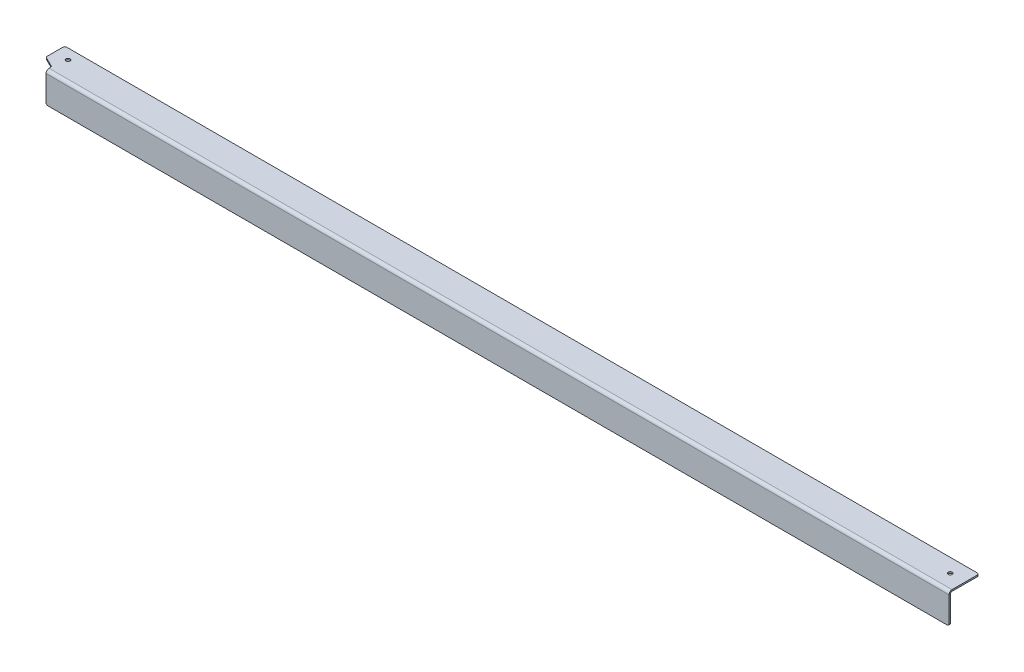
ISO-10303-21;
HEADER;
FILE_DESCRIPTION(('STEP AP214'),'2;1');
FILE_NAME('part.step','',(''),(''),'','','');
FILE_SCHEMA(('AUTOMOTIVE_DESIGN { 1 0 10303 214 1 1 1 1 }'));
ENDSEC;
DATA;
#1=APPLICATION_CONTEXT('core data for automotive mechanical design processes');
#2=APPLICATION_PROTOCOL_DEFINITION('international standard','automotive_design',2000,#1);
#3=PRODUCT_CONTEXT('',#1,'mechanical');
#4=PRODUCT('Part','Part','',(#3));
#5=PRODUCT_RELATED_PRODUCT_CATEGORY('part','',(#4));
#6=PRODUCT_DEFINITION_FORMATION('','',#4);
#7=PRODUCT_DEFINITION_CONTEXT('part definition',#1,'design');
#8=PRODUCT_DEFINITION('design','',#6,#7);
#9=PRODUCT_DEFINITION_SHAPE('','',#8);
#10=(LENGTH_UNIT() NAMED_UNIT(*) SI_UNIT(.MILLI.,.METRE.));
#11=(NAMED_UNIT(*) PLANE_ANGLE_UNIT() SI_UNIT($,.RADIAN.));
#12=(NAMED_UNIT(*) SI_UNIT($,.STERADIAN.) SOLID_ANGLE_UNIT());
#13=UNCERTAINTY_MEASURE_WITH_UNIT(LENGTH_MEASURE(1.E-05),#10,'distance_accuracy_value','');
#14=(GEOMETRIC_REPRESENTATION_CONTEXT(3) GLOBAL_UNCERTAINTY_ASSIGNED_CONTEXT((#13)) GLOBAL_UNIT_ASSIGNED_CONTEXT((#10,
#11,#12)) REPRESENTATION_CONTEXT('',''));
#15=CARTESIAN_POINT('',(0.,0.,0.));
#16=DIRECTION('',(0.,0.,1.));
#17=DIRECTION('',(1.,0.,0.));
#18=AXIS2_PLACEMENT_3D('',#15,#16,#17);
#19=CARTESIAN_POINT('',(0.,-2.5908,0.));
#20=DIRECTION('',(-1.,0.,0.));
#21=DIRECTION('',(0.,0.,1.));
#22=AXIS2_PLACEMENT_3D('',#19,#20,#21);
#23=PLANE('',#22);
#24=DIRECTION('',(0.,0.,1.));
#25=VECTOR('',#24,1.);
#26=CARTESIAN_POINT('',(0.,0.,0.));
#27=LINE('',#26,#25);
#28=CARTESIAN_POINT('',(0.,0.,-7.56274208571908));
#29=VERTEX_POINT('',#28);
#30=CARTESIAN_POINT('',(0.,0.,-5.13079999999999));
#31=VERTEX_POINT('',#30);
#32=EDGE_CURVE('E242',#29,#31,#27,.T.);
#33=ORIENTED_EDGE('',*,*,#32,.F.);
#34=DIRECTION('',(0.,1.,0.));
#35=VECTOR('',#34,1.);
#36=CARTESIAN_POINT('',(0.,-2.5908,-7.56274208571908));
#37=LINE('',#36,#35);
#38=CARTESIAN_POINT('',(0.,-2.5908,-7.56274208571908));
#39=VERTEX_POINT('',#38);
#40=EDGE_CURVE('E316',#29,#39,#37,.F.);
#41=ORIENTED_EDGE('',*,*,#40,.T.);
#42=DIRECTION('',(0.,0.,1.));
#43=VECTOR('',#42,1.);
#44=CARTESIAN_POINT('',(0.,-2.5908,0.));
#45=LINE('',#44,#43);
#46=CARTESIAN_POINT('',(0.,-2.5908,-5.13079999999999));
#47=VERTEX_POINT('',#46);
#48=EDGE_CURVE('E245',#39,#47,#45,.T.);
#49=ORIENTED_EDGE('',*,*,#48,.T.);
#50=DIRECTION('',(0.,1.,0.));
#51=VECTOR('',#50,1.);
#52=CARTESIAN_POINT('',(0.,-2.59079999999999,-5.13079999999999));
#53=LINE('',#52,#51);
#54=EDGE_CURVE('E231',#47,#31,#53,.T.);
#55=ORIENTED_EDGE('',*,*,#54,.T.);
#56=EDGE_LOOP('',(#33,#41,#49,#55));
#57=FACE_BOUND('',#56,.T.);
#58=ADVANCED_FACE('F61',(#57),#23,.T.);
#59=CARTESIAN_POINT('',(0.,-2.5908,0.));
#60=DIRECTION('',(0.,-1.,0.));
#61=DIRECTION('',(0.,0.,-1.));
#62=AXIS2_PLACEMENT_3D('',#59,#60,#61);
#63=PLANE('',#62);
#64=CARTESIAN_POINT('',(3.81,-2.5908,-33.3375));
#65=DIRECTION('',(0.,-1.,0.));
#66=DIRECTION('',(0.,0.,-1.));
#67=AXIS2_PLACEMENT_3D('',#64,#65,#66);
#68=CIRCLE('',#67,3.37350099999998);
#69=CARTESIAN_POINT('',(3.81,-2.5908,-36.711001));
#70=VERTEX_POINT('',#69);
#71=EDGE_CURVE('E433',#70,#70,#68,.T.);
#72=ORIENTED_EDGE('',*,*,#71,.F.);
#73=EDGE_LOOP('',(#72));
#74=FACE_BOUND('',#73,.T.);
#75=CARTESIAN_POINT('',(1498.6,-2.5908,-27.305));
#76=DIRECTION('',(0.,-1.,0.));
#77=DIRECTION('',(0.,0.,-1.));
#78=AXIS2_PLACEMENT_3D('',#75,#76,#77);
#79=CIRCLE('',#78,3.373501);
#80=CARTESIAN_POINT('',(1498.6,-2.5908,-30.678501));
#81=VERTEX_POINT('',#80);
#82=EDGE_CURVE('E228',#81,#81,#79,.T.);
#83=ORIENTED_EDGE('',*,*,#82,.F.);
#84=EDGE_LOOP('',(#83));
#85=FACE_BOUND('',#84,.T.);
#86=DIRECTION('',(-1.,0.,0.));
#87=VECTOR('',#86,1.);
#88=CARTESIAN_POINT('',(-19.05,-2.5908,-50.8));
#89=LINE('',#88,#87);
#90=CARTESIAN_POINT('',(1520.825,-2.5908,-50.8));
#91=VERTEX_POINT('',#90);
#92=CARTESIAN_POINT('',(-15.875,-2.5908,-50.8));
#93=VERTEX_POINT('',#92);
#94=EDGE_CURVE('E251',#91,#93,#89,.T.);
#95=ORIENTED_EDGE('',*,*,#94,.F.);
#96=CARTESIAN_POINT('',(1520.825,-2.5908,-47.625));
#97=DIRECTION('',(0.,-1.,0.));
#98=DIRECTION('',(0.,0.,-1.));
#99=AXIS2_PLACEMENT_3D('',#96,#97,#98);
#100=CIRCLE('',#99,3.175);
#101=CARTESIAN_POINT('',(1524.,-2.5908,-47.625));
#102=VERTEX_POINT('',#101);
#103=EDGE_CURVE('E304',#91,#102,#100,.T.);
#104=ORIENTED_EDGE('',*,*,#103,.T.);
#105=DIRECTION('',(0.,0.,-1.));
#106=VECTOR('',#105,1.);
#107=CARTESIAN_POINT('',(1524.,-2.5908,0.));
#108=LINE('',#107,#106);
#109=CARTESIAN_POINT('',(1524.,-2.5908,-5.13079999999999));
#110=VERTEX_POINT('',#109);
#111=EDGE_CURVE('E247',#110,#102,#108,.T.);
#112=ORIENTED_EDGE('',*,*,#111,.F.);
#113=DIRECTION('',(-1.,0.,0.));
#114=VECTOR('',#113,1.);
#115=CARTESIAN_POINT('',(0.,-2.59079999999999,-5.13079999999999));
#116=LINE('',#115,#114);
#117=EDGE_CURVE('E235',#47,#110,#116,.F.);
#118=ORIENTED_EDGE('',*,*,#117,.F.);
#119=ORIENTED_EDGE('',*,*,#48,.F.);
#120=CARTESIAN_POINT('',(-3.175,-2.5908,-7.56274208571908));
#121=DIRECTION('',(0.,-1.,0.));
#122=DIRECTION('',(0.,0.,-1.));
#123=AXIS2_PLACEMENT_3D('',#120,#121,#122);
#124=CIRCLE('',#123,3.175);
#125=CARTESIAN_POINT('',(-1.75509683428763,-2.5908,-10.4025484171438));
#126=VERTEX_POINT('',#125);
#127=EDGE_CURVE('E13',#39,#126,#124,.F.);
#128=ORIENTED_EDGE('',*,*,#127,.T.);
#129=DIRECTION('',(0.894427190999916,0.,0.447213595499958));
#130=VECTOR('',#129,1.);
#131=CARTESIAN_POINT('',(-19.05,-2.5908,-19.05));
#132=LINE('',#131,#130);
#133=CARTESIAN_POINT('',(-17.2949031657124,-2.5908,-18.1724515828562));
#134=VERTEX_POINT('',#133);
#135=EDGE_CURVE('E256',#134,#126,#132,.T.);
#136=ORIENTED_EDGE('',*,*,#135,.F.);
#137=CARTESIAN_POINT('',(-15.875,-2.5908,-21.0122579142809));
#138=DIRECTION('',(0.,-1.,0.));
#139=DIRECTION('',(0.,0.,-1.));
#140=AXIS2_PLACEMENT_3D('',#137,#138,#139);
#141=CIRCLE('',#140,3.175);
#142=CARTESIAN_POINT('',(-19.05,-2.5908,-21.0122579142809));
#143=VERTEX_POINT('',#142);
#144=EDGE_CURVE('E76',#134,#143,#141,.T.);
#145=ORIENTED_EDGE('',*,*,#144,.T.);
#146=DIRECTION('',(0.,0.,1.));
#147=VECTOR('',#146,1.);
#148=CARTESIAN_POINT('',(-19.05,-2.5908,-50.8));
#149=LINE('',#148,#147);
#150=CARTESIAN_POINT('',(-19.05,-2.5908,-47.625));
#151=VERTEX_POINT('',#150);
#152=EDGE_CURVE('E254',#151,#143,#149,.T.);
#153=ORIENTED_EDGE('',*,*,#152,.F.);
#154=CARTESIAN_POINT('',(-15.875,-2.5908,-47.625));
#155=DIRECTION('',(0.,-1.,0.));
#156=DIRECTION('',(0.,0.,-1.));
#157=AXIS2_PLACEMENT_3D('',#154,#155,#156);
#158=CIRCLE('',#157,3.175);
#159=EDGE_CURVE('E302',#151,#93,#158,.T.);
#160=ORIENTED_EDGE('',*,*,#159,.T.);
#161=EDGE_LOOP('',(#95,#104,#112,#118,#119,#128,#136,#145,#153,#160));
#162=FACE_BOUND('',#161,.T.);
#163=ADVANCED_FACE('F328',(#74,#85,#162),#63,.T.);
#164=CARTESIAN_POINT('',(0.,0.,0.));
#165=DIRECTION('',(0.,-1.,0.));
#166=DIRECTION('',(0.,0.,-1.));
#167=AXIS2_PLACEMENT_3D('',#164,#165,#166);
#168=PLANE('',#167);
#169=CARTESIAN_POINT('',(3.81,0.,-33.3375));
#170=DIRECTION('',(0.,1.,0.));
#171=DIRECTION('',(0.,0.,1.));
#172=AXIS2_PLACEMENT_3D('',#169,#170,#171);
#173=CIRCLE('',#172,3.37350099999999);
#174=CARTESIAN_POINT('',(3.81,0.,-29.963999));
#175=VERTEX_POINT('',#174);
#176=EDGE_CURVE('E436',#175,#175,#173,.T.);
#177=ORIENTED_EDGE('',*,*,#176,.F.);
#178=EDGE_LOOP('',(#177));
#179=FACE_BOUND('',#178,.T.);
#180=CARTESIAN_POINT('',(1498.6,0.,-27.305));
#181=DIRECTION('',(0.,1.,0.));
#182=DIRECTION('',(0.,0.,1.));
#183=AXIS2_PLACEMENT_3D('',#180,#181,#182);
#184=CIRCLE('',#183,3.373501);
#185=CARTESIAN_POINT('',(1498.6,0.,-23.931499));
#186=VERTEX_POINT('',#185);
#187=EDGE_CURVE('E438',#186,#186,#184,.T.);
#188=ORIENTED_EDGE('',*,*,#187,.F.);
#189=EDGE_LOOP('',(#188));
#190=FACE_BOUND('',#189,.T.);
#191=DIRECTION('',(0.,0.,-1.));
#192=VECTOR('',#191,1.);
#193=CARTESIAN_POINT('',(1524.,0.,0.));
#194=LINE('',#193,#192);
#195=CARTESIAN_POINT('',(1524.,0.,-5.13079999999999));
#196=VERTEX_POINT('',#195);
#197=CARTESIAN_POINT('',(1524.,0.,-47.625));
#198=VERTEX_POINT('',#197);
#199=EDGE_CURVE('E261',#196,#198,#194,.T.);
#200=ORIENTED_EDGE('',*,*,#199,.T.);
#201=CARTESIAN_POINT('',(1520.825,0.,-47.625));
#202=DIRECTION('',(0.,-1.,0.));
#203=DIRECTION('',(0.,0.,-1.));
#204=AXIS2_PLACEMENT_3D('',#201,#202,#203);
#205=CIRCLE('',#204,3.175);
#206=CARTESIAN_POINT('',(1520.825,0.,-50.8));
#207=VERTEX_POINT('',#206);
#208=EDGE_CURVE('E294',#198,#207,#205,.F.);
#209=ORIENTED_EDGE('',*,*,#208,.T.);
#210=DIRECTION('',(-1.,0.,0.));
#211=VECTOR('',#210,1.);
#212=CARTESIAN_POINT('',(-19.05,0.,-50.8));
#213=LINE('',#212,#211);
#214=CARTESIAN_POINT('',(-15.875,0.,-50.8));
#215=VERTEX_POINT('',#214);
#216=EDGE_CURVE('E264',#207,#215,#213,.T.);
#217=ORIENTED_EDGE('',*,*,#216,.T.);
#218=CARTESIAN_POINT('',(-15.875,0.,-47.625));
#219=DIRECTION('',(0.,-1.,0.));
#220=DIRECTION('',(0.,0.,-1.));
#221=AXIS2_PLACEMENT_3D('',#218,#219,#220);
#222=CIRCLE('',#221,3.175);
#223=CARTESIAN_POINT('',(-19.05,0.,-47.625));
#224=VERTEX_POINT('',#223);
#225=EDGE_CURVE('E292',#215,#224,#222,.F.);
#226=ORIENTED_EDGE('',*,*,#225,.T.);
#227=DIRECTION('',(0.,0.,1.));
#228=VECTOR('',#227,1.);
#229=CARTESIAN_POINT('',(-19.05,0.,-50.8));
#230=LINE('',#229,#228);
#231=CARTESIAN_POINT('',(-19.05,0.,-21.0122579142809));
#232=VERTEX_POINT('',#231);
#233=EDGE_CURVE('E267',#224,#232,#230,.T.);
#234=ORIENTED_EDGE('',*,*,#233,.T.);
#235=CARTESIAN_POINT('',(-15.875,0.,-21.0122579142809));
#236=DIRECTION('',(0.,-1.,0.));
#237=DIRECTION('',(0.,0.,-1.));
#238=AXIS2_PLACEMENT_3D('',#235,#236,#237);
#239=CIRCLE('',#238,3.175);
#240=CARTESIAN_POINT('',(-17.2949031657124,0.,-18.1724515828562));
#241=VERTEX_POINT('',#240);
#242=EDGE_CURVE('E290',#232,#241,#239,.F.);
#243=ORIENTED_EDGE('',*,*,#242,.T.);
#244=DIRECTION('',(0.894427190999916,0.,0.447213595499958));
#245=VECTOR('',#244,1.);
#246=CARTESIAN_POINT('',(-19.05,0.,-19.05));
#247=LINE('',#246,#245);
#248=CARTESIAN_POINT('',(-1.75509683428763,0.,-10.4025484171438));
#249=VERTEX_POINT('',#248);
#250=EDGE_CURVE('E248',#241,#249,#247,.T.);
#251=ORIENTED_EDGE('',*,*,#250,.T.);
#252=CARTESIAN_POINT('',(-3.175,0.,-7.56274208571908));
#253=DIRECTION('',(0.,-1.,0.));
#254=DIRECTION('',(0.,0.,-1.));
#255=AXIS2_PLACEMENT_3D('',#252,#253,#254);
#256=CIRCLE('',#255,3.175);
#257=EDGE_CURVE('E69',#249,#29,#256,.T.);
#258=ORIENTED_EDGE('',*,*,#257,.T.);
#259=ORIENTED_EDGE('',*,*,#32,.T.);
#260=DIRECTION('',(-1.,0.,0.));
#261=VECTOR('',#260,1.);
#262=CARTESIAN_POINT('',(0.,0.,-5.13079999999999));
#263=LINE('',#262,#261);
#264=EDGE_CURVE('E183',#31,#196,#263,.F.);
#265=ORIENTED_EDGE('',*,*,#264,.T.);
#266=EDGE_LOOP('',(#200,#209,#217,#226,#234,#243,#251,#258,#259,#265));
#267=FACE_BOUND('',#266,.T.);
#268=ADVANCED_FACE('F319',(#179,#190,#267),#168,.F.);
#269=CARTESIAN_POINT('',(-19.05,-2.5908,-19.05));
#270=DIRECTION('',(-0.447213595499958,0.,0.894427190999916));
#271=DIRECTION('',(0.894427190999916,0.,0.447213595499958));
#272=AXIS2_PLACEMENT_3D('',#269,#270,#271);
#273=PLANE('',#272);
#274=ORIENTED_EDGE('',*,*,#250,.F.);
#275=DIRECTION('',(0.,1.,0.));
#276=VECTOR('',#275,1.);
#277=CARTESIAN_POINT('',(-17.2949031657124,-2.5908,-18.1724515828562));
#278=LINE('',#277,#276);
#279=EDGE_CURVE('E314',#241,#134,#278,.F.);
#280=ORIENTED_EDGE('',*,*,#279,.T.);
#281=ORIENTED_EDGE('',*,*,#135,.T.);
#282=DIRECTION('',(0.,1.,0.));
#283=VECTOR('',#282,1.);
#284=CARTESIAN_POINT('',(-1.75509683428763,0.,-10.4025484171438));
#285=LINE('',#284,#283);
#286=EDGE_CURVE('E311',#126,#249,#285,.T.);
#287=ORIENTED_EDGE('',*,*,#286,.T.);
#288=EDGE_LOOP('',(#274,#280,#281,#287));
#289=FACE_BOUND('',#288,.T.);
#290=ADVANCED_FACE('F331',(#289),#273,.T.);
#291=CARTESIAN_POINT('',(-19.05,-2.5908,-50.8));
#292=DIRECTION('',(-1.,0.,0.));
#293=DIRECTION('',(0.,0.,1.));
#294=AXIS2_PLACEMENT_3D('',#291,#292,#293);
#295=PLANE('',#294);
#296=ORIENTED_EDGE('',*,*,#233,.F.);
#297=DIRECTION('',(0.,1.,0.));
#298=VECTOR('',#297,1.);
#299=CARTESIAN_POINT('',(-19.05,-2.5908,-47.625));
#300=LINE('',#299,#298);
#301=EDGE_CURVE('E83',#224,#151,#300,.F.);
#302=ORIENTED_EDGE('',*,*,#301,.T.);
#303=ORIENTED_EDGE('',*,*,#152,.T.);
#304=DIRECTION('',(0.,1.,0.));
#305=VECTOR('',#304,1.);
#306=CARTESIAN_POINT('',(-19.05,-2.5908,-21.0122579142809));
#307=LINE('',#306,#305);
#308=EDGE_CURVE('E307',#143,#232,#307,.T.);
#309=ORIENTED_EDGE('',*,*,#308,.T.);
#310=EDGE_LOOP('',(#296,#302,#303,#309));
#311=FACE_BOUND('',#310,.T.);
#312=ADVANCED_FACE('F336',(#311),#295,.T.);
#313=CARTESIAN_POINT('',(-19.05,-2.5908,-50.8));
#314=DIRECTION('',(0.,0.,-1.));
#315=DIRECTION('',(-1.,0.,0.));
#316=AXIS2_PLACEMENT_3D('',#313,#314,#315);
#317=PLANE('',#316);
#318=ORIENTED_EDGE('',*,*,#216,.F.);
#319=DIRECTION('',(0.,1.,0.));
#320=VECTOR('',#319,1.);
#321=CARTESIAN_POINT('',(1520.825,-2.5908,-50.8));
#322=LINE('',#321,#320);
#323=EDGE_CURVE('E299',#207,#91,#322,.F.);
#324=ORIENTED_EDGE('',*,*,#323,.T.);
#325=ORIENTED_EDGE('',*,*,#94,.T.);
#326=DIRECTION('',(0.,1.,0.));
#327=VECTOR('',#326,1.);
#328=CARTESIAN_POINT('',(-15.875,-2.5908,-50.8));
#329=LINE('',#328,#327);
#330=EDGE_CURVE('E296',#93,#215,#329,.T.);
#331=ORIENTED_EDGE('',*,*,#330,.T.);
#332=EDGE_LOOP('',(#318,#324,#325,#331));
#333=FACE_BOUND('',#332,.T.);
#334=ADVANCED_FACE('F343',(#333),#317,.T.);
#335=CARTESIAN_POINT('',(1524.,-2.5908,0.));
#336=DIRECTION('',(1.,0.,0.));
#337=DIRECTION('',(0.,0.,-1.));
#338=AXIS2_PLACEMENT_3D('',#335,#336,#337);
#339=PLANE('',#338);
#340=ORIENTED_EDGE('',*,*,#111,.T.);
#341=DIRECTION('',(0.,1.,0.));
#342=VECTOR('',#341,1.);
#343=CARTESIAN_POINT('',(1524.,-2.5908,-47.625));
#344=LINE('',#343,#342);
#345=EDGE_CURVE('E287',#102,#198,#344,.T.);
#346=ORIENTED_EDGE('',*,*,#345,.T.);
#347=ORIENTED_EDGE('',*,*,#199,.F.);
#348=DIRECTION('',(0.,1.,0.));
#349=VECTOR('',#348,1.);
#350=CARTESIAN_POINT('',(1524.,-2.59079999999999,-5.13079999999999));
#351=LINE('',#350,#349);
#352=EDGE_CURVE('E239',#110,#196,#351,.T.);
#353=ORIENTED_EDGE('',*,*,#352,.F.);
#354=EDGE_LOOP('',(#340,#346,#347,#353));
#355=FACE_BOUND('',#354,.T.);
#356=ADVANCED_FACE('F352',(#355),#339,.T.);
#357=CARTESIAN_POINT('',(1524.,-5.13079999999999,-5.13079999999999));
#358=DIRECTION('',(1.,0.,0.));
#359=DIRECTION('',(0.,0.,-1.));
#360=AXIS2_PLACEMENT_3D('',#357,#358,#359);
#361=PLANE('',#360);
#362=DIRECTION('',(0.,0.,-1.));
#363=VECTOR('',#362,1.);
#364=CARTESIAN_POINT('',(1524.,-5.13079999999999,0.));
#365=LINE('',#364,#363);
#366=CARTESIAN_POINT('',(1524.,-5.13079999999998,-2.59079999999999));
#367=VERTEX_POINT('',#366);
#368=CARTESIAN_POINT('',(1524.,-5.13079999999997,0.));
#369=VERTEX_POINT('',#368);
#370=EDGE_CURVE('E225',#367,#369,#365,.F.);
#371=ORIENTED_EDGE('',*,*,#370,.F.);
#372=CARTESIAN_POINT('',(1524.,-5.13079999999999,-5.13079999999999));
#373=DIRECTION('',(-1.,0.,0.));
#374=DIRECTION('',(0.,0.,1.));
#375=AXIS2_PLACEMENT_3D('',#372,#373,#374);
#376=CIRCLE('',#375,2.54);
#377=EDGE_CURVE('E186',#110,#367,#376,.F.);
#378=ORIENTED_EDGE('',*,*,#377,.F.);
#379=ORIENTED_EDGE('',*,*,#352,.T.);
#380=CARTESIAN_POINT('',(1524.,-5.13079999999999,-5.13079999999999));
#381=DIRECTION('',(-1.,0.,0.));
#382=DIRECTION('',(0.,0.,1.));
#383=AXIS2_PLACEMENT_3D('',#380,#381,#382);
#384=CIRCLE('',#383,5.1308);
#385=EDGE_CURVE('E230',#196,#369,#384,.F.);
#386=ORIENTED_EDGE('',*,*,#385,.T.);
#387=EDGE_LOOP('',(#371,#378,#379,#386));
#388=FACE_BOUND('',#387,.T.);
#389=ADVANCED_FACE('F359',(#388),#361,.T.);
#390=CARTESIAN_POINT('',(0.,-5.13079999999999,-5.13079999999999));
#391=DIRECTION('',(1.,0.,0.));
#392=DIRECTION('',(0.,0.,-1.));
#393=AXIS2_PLACEMENT_3D('',#390,#391,#392);
#394=PLANE('',#393);
#395=CARTESIAN_POINT('',(0.,-5.13079999999999,-5.13079999999999));
#396=DIRECTION('',(-1.,0.,0.));
#397=DIRECTION('',(0.,0.,1.));
#398=AXIS2_PLACEMENT_3D('',#395,#396,#397);
#399=CIRCLE('',#398,2.54);
#400=CARTESIAN_POINT('',(0.,-5.13079999999998,-2.59079999999999));
#401=VERTEX_POINT('',#400);
#402=EDGE_CURVE('E193',#401,#47,#399,.T.);
#403=ORIENTED_EDGE('',*,*,#402,.F.);
#404=DIRECTION('',(0.,0.,-1.));
#405=VECTOR('',#404,1.);
#406=CARTESIAN_POINT('',(0.,-5.13079999999999,-2.59079999999999));
#407=LINE('',#406,#405);
#408=CARTESIAN_POINT('',(0.,-5.13079999999999,0.));
#409=VERTEX_POINT('',#408);
#410=EDGE_CURVE('E190',#401,#409,#407,.F.);
#411=ORIENTED_EDGE('',*,*,#410,.T.);
#412=CARTESIAN_POINT('',(0.,-5.13079999999999,-5.13079999999999));
#413=DIRECTION('',(-1.,0.,0.));
#414=DIRECTION('',(0.,0.,1.));
#415=AXIS2_PLACEMENT_3D('',#412,#413,#414);
#416=CIRCLE('',#415,5.1308);
#417=EDGE_CURVE('E176',#409,#31,#416,.T.);
#418=ORIENTED_EDGE('',*,*,#417,.T.);
#419=ORIENTED_EDGE('',*,*,#54,.F.);
#420=EDGE_LOOP('',(#403,#411,#418,#419));
#421=FACE_BOUND('',#420,.T.);
#422=ADVANCED_FACE('F191',(#421),#394,.F.);
#423=CARTESIAN_POINT('',(0.,-5.13079999999999,-5.13079999999999));
#424=DIRECTION('',(-1.,0.,0.));
#425=DIRECTION('',(0.,0.,1.));
#426=AXIS2_PLACEMENT_3D('',#423,#424,#425);
#427=CYLINDRICAL_SURFACE('',#426,5.1308);
#428=ORIENTED_EDGE('',*,*,#264,.F.);
#429=ORIENTED_EDGE('',*,*,#417,.F.);
#430=DIRECTION('',(-1.,0.,0.));
#431=VECTOR('',#430,1.);
#432=CARTESIAN_POINT('',(1524.,-5.13079999999999,0.));
#433=LINE('',#432,#431);
#434=EDGE_CURVE('E181',#409,#369,#433,.F.);
#435=ORIENTED_EDGE('',*,*,#434,.T.);
#436=ORIENTED_EDGE('',*,*,#385,.F.);
#437=EDGE_LOOP('',(#428,#429,#435,#436));
#438=FACE_BOUND('',#437,.T.);
#439=ADVANCED_FACE('F178',(#438),#427,.T.);
#440=CARTESIAN_POINT('',(0.,-5.13079999999999,-5.13079999999999));
#441=DIRECTION('',(-1.,0.,0.));
#442=DIRECTION('',(0.,0.,1.));
#443=AXIS2_PLACEMENT_3D('',#440,#441,#442);
#444=CYLINDRICAL_SURFACE('',#443,2.54);
#445=ORIENTED_EDGE('',*,*,#117,.T.);
#446=ORIENTED_EDGE('',*,*,#377,.T.);
#447=DIRECTION('',(-1.,0.,0.));
#448=VECTOR('',#447,1.);
#449=CARTESIAN_POINT('',(1524.,-5.13079999999999,-2.59079999999999));
#450=LINE('',#449,#448);
#451=EDGE_CURVE('E198',#367,#401,#450,.T.);
#452=ORIENTED_EDGE('',*,*,#451,.T.);
#453=ORIENTED_EDGE('',*,*,#402,.T.);
#454=EDGE_LOOP('',(#445,#446,#452,#453));
#455=FACE_BOUND('',#454,.T.);
#456=ADVANCED_FACE('F355',(#455),#444,.F.);
#457=CARTESIAN_POINT('',(0.,-50.8,1.6826817716975E-13));
#458=DIRECTION('',(1.,0.,0.));
#459=DIRECTION('',(0.,0.,-1.));
#460=AXIS2_PLACEMENT_3D('',#457,#458,#459);
#461=PLANE('',#460);
#462=DIRECTION('',(0.,1.,0.));
#463=VECTOR('',#462,1.);
#464=CARTESIAN_POINT('',(0.,-50.8,-2.59079999999983));
#465=LINE('',#464,#463);
#466=CARTESIAN_POINT('',(0.,-47.625,-2.59079999999984));
#467=VERTEX_POINT('',#466);
#468=EDGE_CURVE('E208',#401,#467,#465,.F.);
#469=ORIENTED_EDGE('',*,*,#468,.T.);
#470=DIRECTION('',(0.,0.,-1.));
#471=VECTOR('',#470,1.);
#472=CARTESIAN_POINT('',(0.,-47.625,1.57182723918923E-13));
#473=LINE('',#472,#471);
#474=CARTESIAN_POINT('',(0.,-47.625,1.57174500513526E-13));
#475=VERTEX_POINT('',#474);
#476=EDGE_CURVE('E212',#467,#475,#473,.F.);
#477=ORIENTED_EDGE('',*,*,#476,.T.);
#478=DIRECTION('',(0.,-1.,0.));
#479=VECTOR('',#478,1.);
#480=CARTESIAN_POINT('',(0.,0.,0.));
#481=LINE('',#480,#479);
#482=EDGE_CURVE('E204',#409,#475,#481,.T.);
#483=ORIENTED_EDGE('',*,*,#482,.F.);
#484=ORIENTED_EDGE('',*,*,#410,.F.);
#485=EDGE_LOOP('',(#469,#477,#483,#484));
#486=FACE_BOUND('',#485,.T.);
#487=ADVANCED_FACE('F210',(#486),#461,.F.);
#488=CARTESIAN_POINT('',(1524.,-2.59079999999999,0.));
#489=DIRECTION('',(-1.,0.,0.));
#490=DIRECTION('',(0.,0.,1.));
#491=AXIS2_PLACEMENT_3D('',#488,#489,#490);
#492=PLANE('',#491);
#493=DIRECTION('',(0.,1.,0.));
#494=VECTOR('',#493,1.);
#495=CARTESIAN_POINT('',(1524.,0.,0.));
#496=LINE('',#495,#494);
#497=CARTESIAN_POINT('',(1524.,-47.625,1.57174500513526E-13));
#498=VERTEX_POINT('',#497);
#499=EDGE_CURVE('E207',#498,#369,#496,.T.);
#500=ORIENTED_EDGE('',*,*,#499,.F.);
#501=DIRECTION('',(0.,0.,-1.));
#502=VECTOR('',#501,1.);
#503=CARTESIAN_POINT('',(1524.,-47.625,1.57236068909729E-13));
#504=LINE('',#503,#502);
#505=CARTESIAN_POINT('',(1524.,-47.625,-2.59079999999984));
#506=VERTEX_POINT('',#505);
#507=EDGE_CURVE('E259',#498,#506,#504,.T.);
#508=ORIENTED_EDGE('',*,*,#507,.T.);
#509=DIRECTION('',(0.,-1.,0.));
#510=VECTOR('',#509,1.);
#511=CARTESIAN_POINT('',(1524.,-2.5908,-2.5908));
#512=LINE('',#511,#510);
#513=EDGE_CURVE('E214',#506,#367,#512,.F.);
#514=ORIENTED_EDGE('',*,*,#513,.T.);
#515=ORIENTED_EDGE('',*,*,#370,.T.);
#516=EDGE_LOOP('',(#500,#508,#514,#515));
#517=FACE_BOUND('',#516,.T.);
#518=ADVANCED_FACE('F361',(#517),#492,.F.);
#519=CARTESIAN_POINT('',(0.,0.,0.));
#520=DIRECTION('',(0.,0.,-1.));
#521=DIRECTION('',(0.,1.,0.));
#522=AXIS2_PLACEMENT_3D('',#519,#520,#521);
#523=PLANE('',#522);
#524=DIRECTION('',(1.,0.,0.));
#525=VECTOR('',#524,1.);
#526=CARTESIAN_POINT('',(0.,-50.8,1.68259953764353E-13));
#527=LINE('',#526,#525);
#528=CARTESIAN_POINT('',(3.17499999999993,-50.8,1.68259953764353E-13));
#529=VERTEX_POINT('',#528);
#530=CARTESIAN_POINT('',(1520.825,-50.8,1.68259953764353E-13));
#531=VERTEX_POINT('',#530);
#532=EDGE_CURVE('E213',#529,#531,#527,.T.);
#533=ORIENTED_EDGE('',*,*,#532,.T.);
#534=CARTESIAN_POINT('',(1520.825,-47.625,1.57174500513526E-13));
#535=DIRECTION('',(0.,0.,-1.));
#536=DIRECTION('',(0.,1.,0.));
#537=AXIS2_PLACEMENT_3D('',#534,#535,#536);
#538=CIRCLE('',#537,3.175);
#539=EDGE_CURVE('E285',#531,#498,#538,.F.);
#540=ORIENTED_EDGE('',*,*,#539,.T.);
#541=ORIENTED_EDGE('',*,*,#499,.T.);
#542=ORIENTED_EDGE('',*,*,#434,.F.);
#543=ORIENTED_EDGE('',*,*,#482,.T.);
#544=CARTESIAN_POINT('',(3.17499999999993,-47.625,1.57174500513526E-13));
#545=DIRECTION('',(0.,0.,-1.));
#546=DIRECTION('',(0.,1.,0.));
#547=AXIS2_PLACEMENT_3D('',#544,#545,#546);
#548=CIRCLE('',#547,3.175);
#549=EDGE_CURVE('E283',#475,#529,#548,.F.);
#550=ORIENTED_EDGE('',*,*,#549,.T.);
#551=EDGE_LOOP('',(#533,#540,#541,#542,#543,#550));
#552=FACE_BOUND('',#551,.T.);
#553=ADVANCED_FACE('F203',(#552),#523,.F.);
#554=CARTESIAN_POINT('',(0.,0.,-2.59080000000001));
#555=DIRECTION('',(0.,0.,-1.));
#556=DIRECTION('',(0.,1.,0.));
#557=AXIS2_PLACEMENT_3D('',#554,#555,#556);
#558=PLANE('',#557);
#559=ORIENTED_EDGE('',*,*,#513,.F.);
#560=CARTESIAN_POINT('',(1520.825,-47.625,-2.59079999999984));
#561=DIRECTION('',(0.,0.,-1.));
#562=DIRECTION('',(0.,1.,0.));
#563=AXIS2_PLACEMENT_3D('',#560,#561,#562);
#564=CIRCLE('',#563,3.175);
#565=CARTESIAN_POINT('',(1520.825,-50.8,-2.59079999999983));
#566=VERTEX_POINT('',#565);
#567=EDGE_CURVE('E276',#506,#566,#564,.T.);
#568=ORIENTED_EDGE('',*,*,#567,.T.);
#569=DIRECTION('',(-1.,0.,0.));
#570=VECTOR('',#569,1.);
#571=CARTESIAN_POINT('',(1524.,-50.8,-2.59079999999983));
#572=LINE('',#571,#570);
#573=CARTESIAN_POINT('',(3.17499999999993,-50.8,-2.59079999999983));
#574=VERTEX_POINT('',#573);
#575=EDGE_CURVE('E217',#574,#566,#572,.F.);
#576=ORIENTED_EDGE('',*,*,#575,.F.);
#577=CARTESIAN_POINT('',(3.17499999999993,-47.625,-2.59079999999984));
#578=DIRECTION('',(0.,0.,-1.));
#579=DIRECTION('',(0.,1.,0.));
#580=AXIS2_PLACEMENT_3D('',#577,#578,#579);
#581=CIRCLE('',#580,3.175);
#582=EDGE_CURVE('E274',#574,#467,#581,.T.);
#583=ORIENTED_EDGE('',*,*,#582,.T.);
#584=ORIENTED_EDGE('',*,*,#468,.F.);
#585=ORIENTED_EDGE('',*,*,#451,.F.);
#586=EDGE_LOOP('',(#559,#568,#576,#583,#584,#585));
#587=FACE_BOUND('',#586,.T.);
#588=ADVANCED_FACE('F365',(#587),#558,.T.);
#589=CARTESIAN_POINT('',(1524.,-50.8,1.6826817716975E-13));
#590=DIRECTION('',(0.,1.,0.));
#591=DIRECTION('',(0.,0.,1.));
#592=AXIS2_PLACEMENT_3D('',#589,#590,#591);
#593=PLANE('',#592);
#594=ORIENTED_EDGE('',*,*,#575,.T.);
#595=DIRECTION('',(0.,0.,-1.));
#596=VECTOR('',#595,1.);
#597=CARTESIAN_POINT('',(1520.825,-50.8,1.6826817716975E-13));
#598=LINE('',#597,#596);
#599=EDGE_CURVE('E281',#566,#531,#598,.F.);
#600=ORIENTED_EDGE('',*,*,#599,.T.);
#601=ORIENTED_EDGE('',*,*,#532,.F.);
#602=DIRECTION('',(0.,0.,-1.));
#603=VECTOR('',#602,1.);
#604=CARTESIAN_POINT('',(3.17499999999993,-50.8,1.6826817716975E-13));
#605=LINE('',#604,#603);
#606=EDGE_CURVE('E278',#529,#574,#605,.T.);
#607=ORIENTED_EDGE('',*,*,#606,.T.);
#608=EDGE_LOOP('',(#594,#600,#601,#607));
#609=FACE_BOUND('',#608,.T.);
#610=ADVANCED_FACE('F373',(#609),#593,.F.);
#611=CARTESIAN_POINT('',(1498.6,0.,-27.305));
#612=DIRECTION('',(0.,1.,0.));
#613=DIRECTION('',(0.,0.,1.));
#614=AXIS2_PLACEMENT_3D('',#611,#612,#613);
#615=CYLINDRICAL_SURFACE('',#614,3.373501);
#616=ORIENTED_EDGE('',*,*,#82,.T.);
#617=EDGE_LOOP('',(#616));
#618=FACE_BOUND('',#617,.T.);
#619=ORIENTED_EDGE('',*,*,#187,.T.);
#620=EDGE_LOOP('',(#619));
#621=FACE_BOUND('',#620,.T.);
#622=ADVANCED_FACE('F378',(#618,#621),#615,.F.);
#623=CARTESIAN_POINT('',(1520.825,-47.625,1.57236068909729E-13));
#624=DIRECTION('',(0.,0.,-1.));
#625=DIRECTION('',(0.,1.,0.));
#626=AXIS2_PLACEMENT_3D('',#623,#624,#625);
#627=CYLINDRICAL_SURFACE('',#626,3.175);
#628=ORIENTED_EDGE('',*,*,#539,.F.);
#629=ORIENTED_EDGE('',*,*,#599,.F.);
#630=ORIENTED_EDGE('',*,*,#567,.F.);
#631=ORIENTED_EDGE('',*,*,#507,.F.);
#632=EDGE_LOOP('',(#628,#629,#630,#631));
#633=FACE_BOUND('',#632,.T.);
#634=ADVANCED_FACE('F376',(#633),#627,.T.);
#635=CARTESIAN_POINT('',(1520.825,-2.5908,-47.625));
#636=DIRECTION('',(0.,1.,0.));
#637=DIRECTION('',(0.,0.,1.));
#638=AXIS2_PLACEMENT_3D('',#635,#636,#637);
#639=CYLINDRICAL_SURFACE('',#638,3.175);
#640=ORIENTED_EDGE('',*,*,#103,.F.);
#641=ORIENTED_EDGE('',*,*,#323,.F.);
#642=ORIENTED_EDGE('',*,*,#208,.F.);
#643=ORIENTED_EDGE('',*,*,#345,.F.);
#644=EDGE_LOOP('',(#640,#641,#642,#643));
#645=FACE_BOUND('',#644,.T.);
#646=ADVANCED_FACE('F349',(#645),#639,.T.);
#647=CARTESIAN_POINT('',(3.17499999999993,-47.625,1.57182723918923E-13));
#648=DIRECTION('',(0.,0.,-1.));
#649=DIRECTION('',(0.,1.,0.));
#650=AXIS2_PLACEMENT_3D('',#647,#648,#649);
#651=CYLINDRICAL_SURFACE('',#650,3.175);
#652=ORIENTED_EDGE('',*,*,#549,.F.);
#653=ORIENTED_EDGE('',*,*,#476,.F.);
#654=ORIENTED_EDGE('',*,*,#582,.F.);
#655=ORIENTED_EDGE('',*,*,#606,.F.);
#656=EDGE_LOOP('',(#652,#653,#654,#655));
#657=FACE_BOUND('',#656,.T.);
#658=ADVANCED_FACE('F368',(#657),#651,.T.);
#659=CARTESIAN_POINT('',(-15.875,-2.5908,-47.625));
#660=DIRECTION('',(0.,1.,0.));
#661=DIRECTION('',(0.,0.,1.));
#662=AXIS2_PLACEMENT_3D('',#659,#660,#661);
#663=CYLINDRICAL_SURFACE('',#662,3.175);
#664=ORIENTED_EDGE('',*,*,#159,.F.);
#665=ORIENTED_EDGE('',*,*,#301,.F.);
#666=ORIENTED_EDGE('',*,*,#225,.F.);
#667=ORIENTED_EDGE('',*,*,#330,.F.);
#668=EDGE_LOOP('',(#664,#665,#666,#667));
#669=FACE_BOUND('',#668,.T.);
#670=ADVANCED_FACE('F341',(#669),#663,.T.);
#671=CARTESIAN_POINT('',(-15.875,-2.5908,-21.0122579142809));
#672=DIRECTION('',(0.,1.,0.));
#673=DIRECTION('',(0.,0.,1.));
#674=AXIS2_PLACEMENT_3D('',#671,#672,#673);
#675=CYLINDRICAL_SURFACE('',#674,3.175);
#676=ORIENTED_EDGE('',*,*,#144,.F.);
#677=ORIENTED_EDGE('',*,*,#279,.F.);
#678=ORIENTED_EDGE('',*,*,#242,.F.);
#679=ORIENTED_EDGE('',*,*,#308,.F.);
#680=EDGE_LOOP('',(#676,#677,#678,#679));
#681=FACE_BOUND('',#680,.T.);
#682=ADVANCED_FACE('F334',(#681),#675,.T.);
#683=CARTESIAN_POINT('',(-3.175,-2.5908,-7.56274208571908));
#684=DIRECTION('',(0.,-1.,0.));
#685=DIRECTION('',(0.,0.,-1.));
#686=AXIS2_PLACEMENT_3D('',#683,#684,#685);
#687=CYLINDRICAL_SURFACE('',#686,3.175);
#688=ORIENTED_EDGE('',*,*,#127,.F.);
#689=ORIENTED_EDGE('',*,*,#40,.F.);
#690=ORIENTED_EDGE('',*,*,#257,.F.);
#691=ORIENTED_EDGE('',*,*,#286,.F.);
#692=EDGE_LOOP('',(#688,#689,#690,#691));
#693=FACE_BOUND('',#692,.T.);
#694=ADVANCED_FACE('F63',(#693),#687,.F.);
#695=CARTESIAN_POINT('',(3.81,0.,-33.3375));
#696=DIRECTION('',(0.,1.,0.));
#697=DIRECTION('',(0.,0.,1.));
#698=AXIS2_PLACEMENT_3D('',#695,#696,#697);
#699=CYLINDRICAL_SURFACE('',#698,3.37350099999998);
#700=ORIENTED_EDGE('',*,*,#71,.T.);
#701=EDGE_LOOP('',(#700));
#702=FACE_BOUND('',#701,.T.);
#703=ORIENTED_EDGE('',*,*,#176,.T.);
#704=EDGE_LOOP('',(#703));
#705=FACE_BOUND('',#704,.T.);
#706=ADVANCED_FACE('F424',(#702,#705),#699,.F.);
#707=CLOSED_SHELL('',(#58,#163,#268,#290,#312,#334,#356,#389,#422,#439,#456,#487,#518,#553,#588,
#610,#622,#634,#646,#658,#670,#682,#694,#706));
#708=MANIFOLD_SOLID_BREP('B2',#707);
#709=ADVANCED_BREP_SHAPE_REPRESENTATION('',(#18,#708),#14);
#710=SHAPE_DEFINITION_REPRESENTATION(#9,#709);
ENDSEC;
END-ISO-10303-21;
